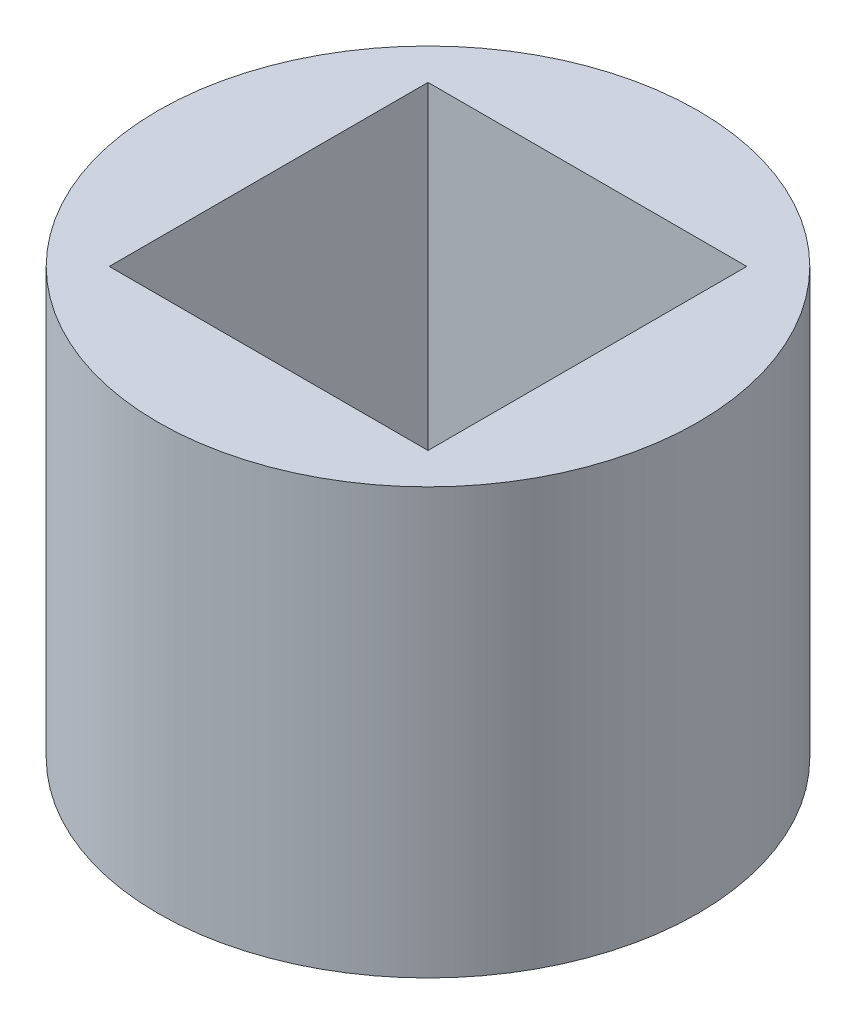
ISO-10303-21;
HEADER;
FILE_DESCRIPTION(('STEP AP214'),'2;1');
FILE_NAME('part.step','',(''),(''),'','','');
FILE_SCHEMA(('AUTOMOTIVE_DESIGN { 1 0 10303 214 1 1 1 1 }'));
ENDSEC;
DATA;
#1=APPLICATION_CONTEXT('core data for automotive mechanical design processes');
#2=APPLICATION_PROTOCOL_DEFINITION('international standard','automotive_design',2000,#1);
#3=PRODUCT_CONTEXT('',#1,'mechanical');
#4=PRODUCT('Part','Part','',(#3));
#5=PRODUCT_RELATED_PRODUCT_CATEGORY('part','',(#4));
#6=PRODUCT_DEFINITION_FORMATION('','',#4);
#7=PRODUCT_DEFINITION_CONTEXT('part definition',#1,'design');
#8=PRODUCT_DEFINITION('design','',#6,#7);
#9=PRODUCT_DEFINITION_SHAPE('','',#8);
#10=(LENGTH_UNIT() NAMED_UNIT(*) SI_UNIT(.MILLI.,.METRE.));
#11=(NAMED_UNIT(*) PLANE_ANGLE_UNIT() SI_UNIT($,.RADIAN.));
#12=(NAMED_UNIT(*) SI_UNIT($,.STERADIAN.) SOLID_ANGLE_UNIT());
#13=UNCERTAINTY_MEASURE_WITH_UNIT(LENGTH_MEASURE(1.E-05),#10,'distance_accuracy_value','');
#14=(GEOMETRIC_REPRESENTATION_CONTEXT(3) GLOBAL_UNCERTAINTY_ASSIGNED_CONTEXT((#13)) GLOBAL_UNIT_ASSIGNED_CONTEXT((#10,
#11,#12)) REPRESENTATION_CONTEXT('',''));
#15=CARTESIAN_POINT('',(0.,0.,0.));
#16=DIRECTION('',(0.,0.,1.));
#17=DIRECTION('',(1.,0.,0.));
#18=AXIS2_PLACEMENT_3D('',#15,#16,#17);
#19=CARTESIAN_POINT('',(0.,20.,0.));
#20=DIRECTION('',(0.,1.,0.));
#21=DIRECTION('',(0.,0.,1.));
#22=AXIS2_PLACEMENT_3D('',#19,#20,#21);
#23=PLANE('',#22);
#24=CARTESIAN_POINT('',(0.,20.,0.));
#25=DIRECTION('',(0.,1.,0.));
#26=DIRECTION('',(0.,0.,1.));
#27=AXIS2_PLACEMENT_3D('',#24,#25,#26);
#28=CIRCLE('',#27,12.695);
#29=CARTESIAN_POINT('',(0.,20.,12.695));
#30=VERTEX_POINT('',#29);
#31=EDGE_CURVE('E11',#30,#30,#28,.T.);
#32=ORIENTED_EDGE('',*,*,#31,.T.);
#33=EDGE_LOOP('',(#32));
#34=FACE_BOUND('',#33,.T.);
#35=DIRECTION('',(-1.,0.,0.));
#36=VECTOR('',#35,1.);
#37=CARTESIAN_POINT('',(-7.495,20.,-7.495));
#38=LINE('',#37,#36);
#39=CARTESIAN_POINT('',(7.495,20.,-7.495));
#40=VERTEX_POINT('',#39);
#41=CARTESIAN_POINT('',(-7.495,20.,-7.495));
#42=VERTEX_POINT('',#41);
#43=EDGE_CURVE('E90',#40,#42,#38,.T.);
#44=ORIENTED_EDGE('',*,*,#43,.F.);
#45=DIRECTION('',(0.,0.,-1.));
#46=VECTOR('',#45,1.);
#47=CARTESIAN_POINT('',(7.495,20.,-7.495));
#48=LINE('',#47,#46);
#49=CARTESIAN_POINT('',(7.495,20.,7.495));
#50=VERTEX_POINT('',#49);
#51=EDGE_CURVE('E81',#50,#40,#48,.T.);
#52=ORIENTED_EDGE('',*,*,#51,.F.);
#53=DIRECTION('',(1.,0.,0.));
#54=VECTOR('',#53,1.);
#55=CARTESIAN_POINT('',(-7.495,20.,7.495));
#56=LINE('',#55,#54);
#57=CARTESIAN_POINT('',(-7.495,20.,7.495));
#58=VERTEX_POINT('',#57);
#59=EDGE_CURVE('E106',#58,#50,#56,.T.);
#60=ORIENTED_EDGE('',*,*,#59,.F.);
#61=DIRECTION('',(0.,0.,1.));
#62=VECTOR('',#61,1.);
#63=CARTESIAN_POINT('',(-7.495,20.,-7.495));
#64=LINE('',#63,#62);
#65=EDGE_CURVE('E102',#42,#58,#64,.T.);
#66=ORIENTED_EDGE('',*,*,#65,.F.);
#67=EDGE_LOOP('',(#44,#52,#60,#66));
#68=FACE_BOUND('',#67,.T.);
#69=ADVANCED_FACE('F39',(#34,#68),#23,.T.);
#70=CARTESIAN_POINT('',(0.,0.,0.));
#71=DIRECTION('',(0.,1.,0.));
#72=DIRECTION('',(0.,0.,1.));
#73=AXIS2_PLACEMENT_3D('',#70,#71,#72);
#74=PLANE('',#73);
#75=CARTESIAN_POINT('',(0.,0.,0.));
#76=DIRECTION('',(0.,1.,0.));
#77=DIRECTION('',(0.,0.,1.));
#78=AXIS2_PLACEMENT_3D('',#75,#76,#77);
#79=CIRCLE('',#78,12.695);
#80=CARTESIAN_POINT('',(0.,0.,12.695));
#81=VERTEX_POINT('',#80);
#82=EDGE_CURVE('E43',#81,#81,#79,.T.);
#83=ORIENTED_EDGE('',*,*,#82,.F.);
#84=EDGE_LOOP('',(#83));
#85=FACE_BOUND('',#84,.T.);
#86=DIRECTION('',(0.,0.,-1.));
#87=VECTOR('',#86,1.);
#88=CARTESIAN_POINT('',(7.495,0.,-7.495));
#89=LINE('',#88,#87);
#90=CARTESIAN_POINT('',(7.495,0.,7.495));
#91=VERTEX_POINT('',#90);
#92=CARTESIAN_POINT('',(7.495,0.,-7.495));
#93=VERTEX_POINT('',#92);
#94=EDGE_CURVE('E63',#91,#93,#89,.T.);
#95=ORIENTED_EDGE('',*,*,#94,.T.);
#96=DIRECTION('',(-1.,0.,0.));
#97=VECTOR('',#96,1.);
#98=CARTESIAN_POINT('',(-7.495,0.,-7.495));
#99=LINE('',#98,#97);
#100=CARTESIAN_POINT('',(-7.495,0.,-7.495));
#101=VERTEX_POINT('',#100);
#102=EDGE_CURVE('E97',#93,#101,#99,.T.);
#103=ORIENTED_EDGE('',*,*,#102,.T.);
#104=DIRECTION('',(0.,0.,1.));
#105=VECTOR('',#104,1.);
#106=CARTESIAN_POINT('',(-7.495,0.,-7.495));
#107=LINE('',#106,#105);
#108=CARTESIAN_POINT('',(-7.495,0.,7.495));
#109=VERTEX_POINT('',#108);
#110=EDGE_CURVE('E115',#101,#109,#107,.T.);
#111=ORIENTED_EDGE('',*,*,#110,.T.);
#112=DIRECTION('',(1.,0.,0.));
#113=VECTOR('',#112,1.);
#114=CARTESIAN_POINT('',(-7.495,0.,7.495));
#115=LINE('',#114,#113);
#116=EDGE_CURVE('E91',#109,#91,#115,.T.);
#117=ORIENTED_EDGE('',*,*,#116,.T.);
#118=EDGE_LOOP('',(#95,#103,#111,#117));
#119=FACE_BOUND('',#118,.T.);
#120=ADVANCED_FACE('F131',(#85,#119),#74,.F.);
#121=CARTESIAN_POINT('',(0.,20.,0.));
#122=DIRECTION('',(0.,-1.,0.));
#123=DIRECTION('',(0.,0.,-1.));
#124=AXIS2_PLACEMENT_3D('',#121,#122,#123);
#125=CYLINDRICAL_SURFACE('',#124,12.695);
#126=ORIENTED_EDGE('',*,*,#31,.F.);
#127=EDGE_LOOP('',(#126));
#128=FACE_BOUND('',#127,.T.);
#129=ORIENTED_EDGE('',*,*,#82,.T.);
#130=EDGE_LOOP('',(#129));
#131=FACE_BOUND('',#130,.T.);
#132=ADVANCED_FACE('F41',(#128,#131),#125,.T.);
#133=CARTESIAN_POINT('',(7.495,20.,-7.495));
#134=DIRECTION('',(-1.,0.,0.));
#135=DIRECTION('',(0.,0.,1.));
#136=AXIS2_PLACEMENT_3D('',#133,#134,#135);
#137=PLANE('',#136);
#138=ORIENTED_EDGE('',*,*,#94,.F.);
#139=DIRECTION('',(0.,-1.,0.));
#140=VECTOR('',#139,1.);
#141=CARTESIAN_POINT('',(7.495,20.,7.495));
#142=LINE('',#141,#140);
#143=EDGE_CURVE('E85',#50,#91,#142,.T.);
#144=ORIENTED_EDGE('',*,*,#143,.F.);
#145=ORIENTED_EDGE('',*,*,#51,.T.);
#146=DIRECTION('',(0.,-1.,0.));
#147=VECTOR('',#146,1.);
#148=CARTESIAN_POINT('',(7.495,20.,-7.495));
#149=LINE('',#148,#147);
#150=EDGE_CURVE('E84',#40,#93,#149,.T.);
#151=ORIENTED_EDGE('',*,*,#150,.T.);
#152=EDGE_LOOP('',(#138,#144,#145,#151));
#153=FACE_BOUND('',#152,.T.);
#154=ADVANCED_FACE('F83',(#153),#137,.T.);
#155=CARTESIAN_POINT('',(-7.495,20.,-7.495));
#156=DIRECTION('',(0.,0.,1.));
#157=DIRECTION('',(1.,0.,0.));
#158=AXIS2_PLACEMENT_3D('',#155,#156,#157);
#159=PLANE('',#158);
#160=ORIENTED_EDGE('',*,*,#102,.F.);
#161=ORIENTED_EDGE('',*,*,#150,.F.);
#162=ORIENTED_EDGE('',*,*,#43,.T.);
#163=DIRECTION('',(0.,-1.,0.));
#164=VECTOR('',#163,1.);
#165=CARTESIAN_POINT('',(-7.495,20.,-7.495));
#166=LINE('',#165,#164);
#167=EDGE_CURVE('E99',#42,#101,#166,.T.);
#168=ORIENTED_EDGE('',*,*,#167,.T.);
#169=EDGE_LOOP('',(#160,#161,#162,#168));
#170=FACE_BOUND('',#169,.T.);
#171=ADVANCED_FACE('F94',(#170),#159,.T.);
#172=CARTESIAN_POINT('',(-7.495,20.,-7.495));
#173=DIRECTION('',(1.,0.,0.));
#174=DIRECTION('',(0.,0.,-1.));
#175=AXIS2_PLACEMENT_3D('',#172,#173,#174);
#176=PLANE('',#175);
#177=ORIENTED_EDGE('',*,*,#110,.F.);
#178=ORIENTED_EDGE('',*,*,#167,.F.);
#179=ORIENTED_EDGE('',*,*,#65,.T.);
#180=DIRECTION('',(0.,-1.,0.));
#181=VECTOR('',#180,1.);
#182=CARTESIAN_POINT('',(-7.495,20.,7.495));
#183=LINE('',#182,#181);
#184=EDGE_CURVE('E55',#58,#109,#183,.T.);
#185=ORIENTED_EDGE('',*,*,#184,.T.);
#186=EDGE_LOOP('',(#177,#178,#179,#185));
#187=FACE_BOUND('',#186,.T.);
#188=ADVANCED_FACE('F129',(#187),#176,.T.);
#189=CARTESIAN_POINT('',(-7.495,20.,7.495));
#190=DIRECTION('',(0.,0.,-1.));
#191=DIRECTION('',(-1.,0.,0.));
#192=AXIS2_PLACEMENT_3D('',#189,#190,#191);
#193=PLANE('',#192);
#194=ORIENTED_EDGE('',*,*,#116,.F.);
#195=ORIENTED_EDGE('',*,*,#184,.F.);
#196=ORIENTED_EDGE('',*,*,#59,.T.);
#197=ORIENTED_EDGE('',*,*,#143,.T.);
#198=EDGE_LOOP('',(#194,#195,#196,#197));
#199=FACE_BOUND('',#198,.T.);
#200=ADVANCED_FACE('F132',(#199),#193,.T.);
#201=CLOSED_SHELL('',(#69,#120,#132,#154,#171,#188,#200));
#202=MANIFOLD_SOLID_BREP('B2',#201);
#203=ADVANCED_BREP_SHAPE_REPRESENTATION('',(#18,#202),#14);
#204=SHAPE_DEFINITION_REPRESENTATION(#9,#203);
ENDSEC;
END-ISO-10303-21;
